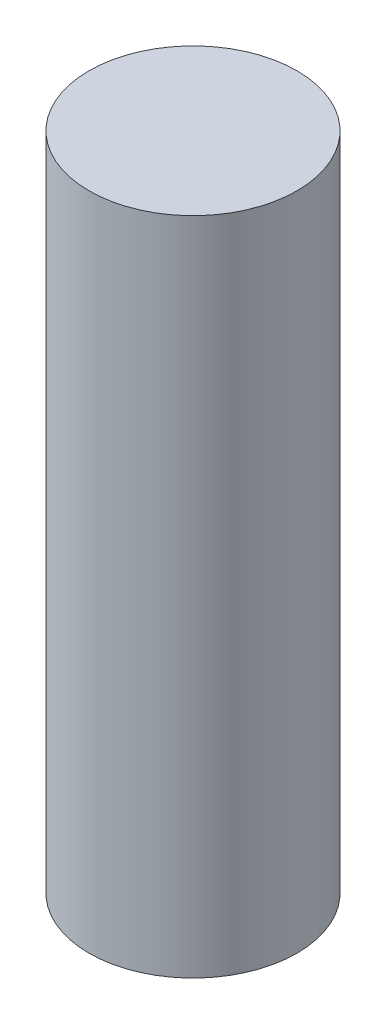
ISO-10303-21;
HEADER;
FILE_DESCRIPTION(('STEP AP214'),'2;1');
FILE_NAME('part.step','',(''),(''),'','','');
FILE_SCHEMA(('AUTOMOTIVE_DESIGN { 1 0 10303 214 1 1 1 1 }'));
ENDSEC;
DATA;
#1=APPLICATION_CONTEXT('core data for automotive mechanical design processes');
#2=APPLICATION_PROTOCOL_DEFINITION('international standard','automotive_design',2000,#1);
#3=PRODUCT_CONTEXT('',#1,'mechanical');
#4=PRODUCT('Part','Part','',(#3));
#5=PRODUCT_RELATED_PRODUCT_CATEGORY('part','',(#4));
#6=PRODUCT_DEFINITION_FORMATION('','',#4);
#7=PRODUCT_DEFINITION_CONTEXT('part definition',#1,'design');
#8=PRODUCT_DEFINITION('design','',#6,#7);
#9=PRODUCT_DEFINITION_SHAPE('','',#8);
#10=(LENGTH_UNIT() NAMED_UNIT(*) SI_UNIT(.MILLI.,.METRE.));
#11=(NAMED_UNIT(*) PLANE_ANGLE_UNIT() SI_UNIT($,.RADIAN.));
#12=(NAMED_UNIT(*) SI_UNIT($,.STERADIAN.) SOLID_ANGLE_UNIT());
#13=UNCERTAINTY_MEASURE_WITH_UNIT(LENGTH_MEASURE(1.E-05),#10,'distance_accuracy_value','');
#14=(GEOMETRIC_REPRESENTATION_CONTEXT(3) GLOBAL_UNCERTAINTY_ASSIGNED_CONTEXT((#13)) GLOBAL_UNIT_ASSIGNED_CONTEXT((#10,
#11,#12)) REPRESENTATION_CONTEXT('',''));
#15=CARTESIAN_POINT('',(0.,0.,0.));
#16=DIRECTION('',(0.,0.,1.));
#17=DIRECTION('',(1.,0.,0.));
#18=AXIS2_PLACEMENT_3D('',#15,#16,#17);
#19=CARTESIAN_POINT('',(0.,12.7,0.));
#20=DIRECTION('',(0.,-1.,0.));
#21=DIRECTION('',(0.,0.,-1.));
#22=AXIS2_PLACEMENT_3D('',#19,#20,#21);
#23=CYLINDRICAL_SURFACE('',#22,2.);
#24=CARTESIAN_POINT('',(0.,12.7,0.));
#25=DIRECTION('',(0.,1.,0.));
#26=DIRECTION('',(0.,0.,1.));
#27=AXIS2_PLACEMENT_3D('',#24,#25,#26);
#28=CIRCLE('',#27,2.);
#29=CARTESIAN_POINT('',(0.,12.7,2.));
#30=VERTEX_POINT('',#29);
#31=EDGE_CURVE('E10',#30,#30,#28,.T.);
#32=ORIENTED_EDGE('',*,*,#31,.F.);
#33=EDGE_LOOP('',(#32));
#34=FACE_BOUND('',#33,.T.);
#35=CARTESIAN_POINT('',(0.,0.,0.));
#36=DIRECTION('',(0.,1.,0.));
#37=DIRECTION('',(0.,0.,1.));
#38=AXIS2_PLACEMENT_3D('',#35,#36,#37);
#39=CIRCLE('',#38,2.);
#40=CARTESIAN_POINT('',(0.,0.,2.));
#41=VERTEX_POINT('',#40);
#42=EDGE_CURVE('E44',#41,#41,#39,.T.);
#43=ORIENTED_EDGE('',*,*,#42,.T.);
#44=EDGE_LOOP('',(#43));
#45=FACE_BOUND('',#44,.T.);
#46=ADVANCED_FACE('F41',(#34,#45),#23,.T.);
#47=CARTESIAN_POINT('',(0.,12.7,0.));
#48=DIRECTION('',(0.,1.,0.));
#49=DIRECTION('',(0.,0.,1.));
#50=AXIS2_PLACEMENT_3D('',#47,#48,#49);
#51=PLANE('',#50);
#52=ORIENTED_EDGE('',*,*,#31,.T.);
#53=EDGE_LOOP('',(#52));
#54=FACE_BOUND('',#53,.T.);
#55=ADVANCED_FACE('F58',(#54),#51,.T.);
#56=CARTESIAN_POINT('',(0.,0.,0.));
#57=DIRECTION('',(0.,1.,0.));
#58=DIRECTION('',(0.,0.,1.));
#59=AXIS2_PLACEMENT_3D('',#56,#57,#58);
#60=PLANE('',#59);
#61=ORIENTED_EDGE('',*,*,#42,.F.);
#62=EDGE_LOOP('',(#61));
#63=FACE_BOUND('',#62,.T.);
#64=ADVANCED_FACE('F56',(#63),#60,.F.);
#65=CLOSED_SHELL('',(#46,#55,#64));
#66=MANIFOLD_SOLID_BREP('B2',#65);
#67=ADVANCED_BREP_SHAPE_REPRESENTATION('',(#18,#66),#14);
#68=SHAPE_DEFINITION_REPRESENTATION(#9,#67);
ENDSEC;
END-ISO-10303-21;
